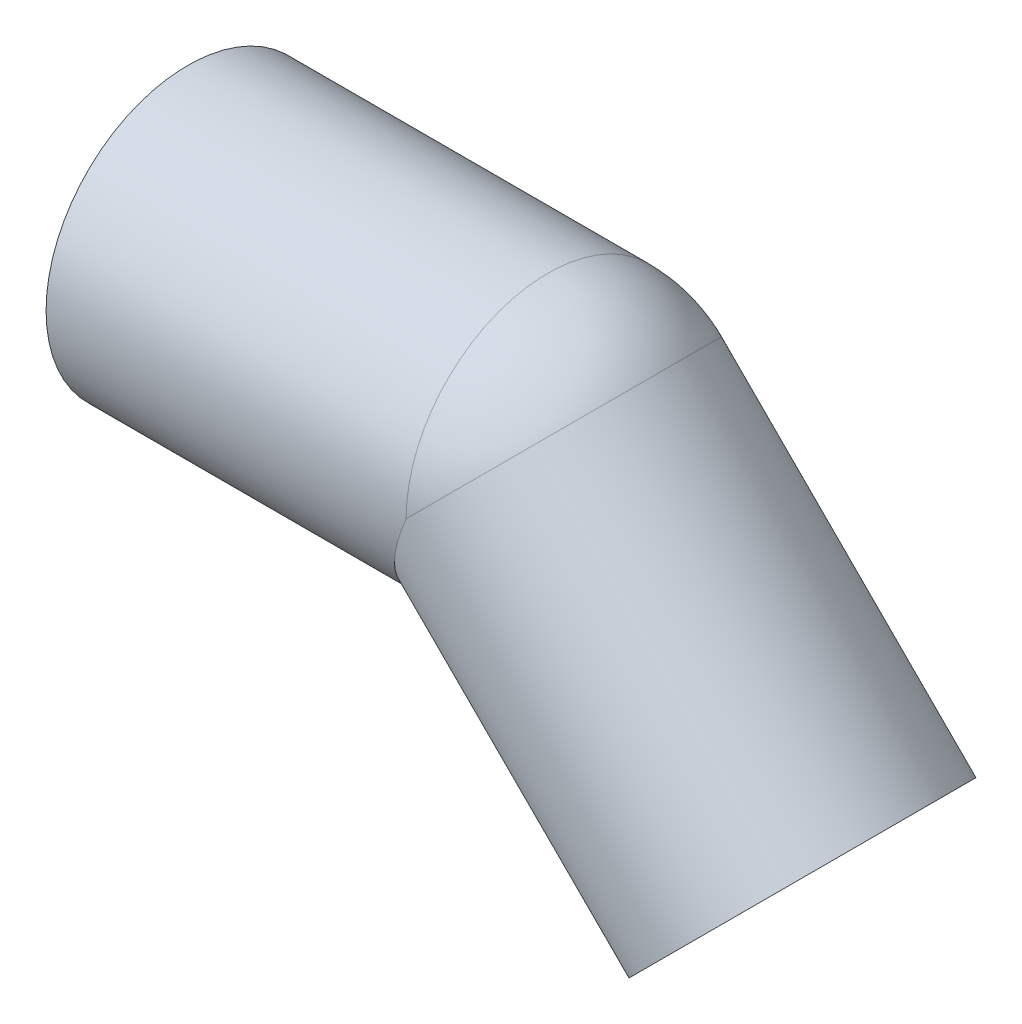
ISO-10303-21;
HEADER;
FILE_DESCRIPTION(('STEP AP214'),'2;1');
FILE_NAME('part.step','',(''),(''),'','','');
FILE_SCHEMA(('AUTOMOTIVE_DESIGN { 1 0 10303 214 1 1 1 1 }'));
ENDSEC;
DATA;
#1=APPLICATION_CONTEXT('core data for automotive mechanical design processes');
#2=APPLICATION_PROTOCOL_DEFINITION('international standard','automotive_design',2000,#1);
#3=PRODUCT_CONTEXT('',#1,'mechanical');
#4=PRODUCT('Part','Part','',(#3));
#5=PRODUCT_RELATED_PRODUCT_CATEGORY('part','',(#4));
#6=PRODUCT_DEFINITION_FORMATION('','',#4);
#7=PRODUCT_DEFINITION_CONTEXT('part definition',#1,'design');
#8=PRODUCT_DEFINITION('design','',#6,#7);
#9=PRODUCT_DEFINITION_SHAPE('','',#8);
#10=(LENGTH_UNIT() NAMED_UNIT(*) SI_UNIT(.MILLI.,.METRE.));
#11=(NAMED_UNIT(*) PLANE_ANGLE_UNIT() SI_UNIT($,.RADIAN.));
#12=(NAMED_UNIT(*) SI_UNIT($,.STERADIAN.) SOLID_ANGLE_UNIT());
#13=UNCERTAINTY_MEASURE_WITH_UNIT(LENGTH_MEASURE(1.E-05),#10,'distance_accuracy_value','');
#14=(GEOMETRIC_REPRESENTATION_CONTEXT(3) GLOBAL_UNCERTAINTY_ASSIGNED_CONTEXT((#13)) GLOBAL_UNIT_ASSIGNED_CONTEXT((#10,
#11,#12)) REPRESENTATION_CONTEXT('',''));
#15=CARTESIAN_POINT('',(0.,0.,0.));
#16=DIRECTION('',(0.,0.,1.));
#17=DIRECTION('',(1.,0.,0.));
#18=AXIS2_PLACEMENT_3D('',#15,#16,#17);
#19=CARTESIAN_POINT('',(136.568542494924,-56.5685424949251,0.));
#20=DIRECTION('',(-0.707106781186529,0.707106781186566,0.));
#21=DIRECTION('',(-0.707106781186566,-0.707106781186529,0.));
#22=AXIS2_PLACEMENT_3D('',#19,#20,#21);
#23=CYLINDRICAL_SURFACE('',#22,25.7);
#24=CARTESIAN_POINT('',(80.,0.,0.));
#25=DIRECTION('',(0.707106781186548,-0.707106781186547,0.));
#26=DIRECTION('',(0.,0.,-1.));
#27=AXIS2_PLACEMENT_3D('',#24,#25,#26);
#28=CIRCLE('',#27,25.7);
#29=CARTESIAN_POINT('',(98.1726442757443,18.1726442772443,0.));
#30=VERTEX_POINT('',#29);
#31=CARTESIAN_POINT('',(80.0000000000013,-5.52546202811329E-13,25.7));
#32=VERTEX_POINT('',#31);
#33=EDGE_CURVE('E53',#30,#32,#28,.T.);
#34=ORIENTED_EDGE('',*,*,#33,.F.);
#35=CARTESIAN_POINT('',(80.,0.,0.));
#36=DIRECTION('',(0.707106781274096,-0.707106781098999,0.));
#37=DIRECTION('',(0.,0.,-1.));
#38=AXIS2_PLACEMENT_3D('',#35,#36,#37);
#39=CIRCLE('',#38,25.7);
#40=CARTESIAN_POINT('',(80.0000000000013,-5.47206972808515E-13,-25.7));
#41=VERTEX_POINT('',#40);
#42=EDGE_CURVE('E46',#41,#30,#39,.T.);
#43=ORIENTED_EDGE('',*,*,#42,.F.);
#44=CARTESIAN_POINT('',(80.0000000000015,0.,0.));
#45=DIRECTION('',(-0.923879532511282,0.382683432365102,0.));
#46=DIRECTION('',(-0.382683432365102,-0.923879532511282,0.));
#47=AXIS2_PLACEMENT_3D('',#44,#45,#46);
#48=ELLIPSE('',#47,27.8174795475147,25.7);
#49=EDGE_CURVE('E55',#32,#41,#48,.F.);
#50=ORIENTED_EDGE('',*,*,#49,.F.);
#51=EDGE_LOOP('',(#34,#43,#50));
#52=FACE_BOUND('',#51,.T.);
#53=CARTESIAN_POINT('',(136.568542494923,-56.5685424949241,0.));
#54=DIRECTION('',(-0.707106781186528,0.707106781186567,0.));
#55=DIRECTION('',(-0.707106781186567,-0.707106781186528,0.));
#56=AXIS2_PLACEMENT_3D('',#53,#54,#55);
#57=CIRCLE('',#56,25.7);
#58=CARTESIAN_POINT('',(118.395898218428,-74.7411867714179,0.));
#59=VERTEX_POINT('',#58);
#60=EDGE_CURVE('E18',#59,#59,#57,.T.);
#61=ORIENTED_EDGE('',*,*,#60,.F.);
#62=EDGE_LOOP('',(#61));
#63=FACE_BOUND('',#62,.T.);
#64=ADVANCED_FACE('F15',(#52,#63),#23,.F.);
#65=CARTESIAN_POINT('',(80.,0.,0.));
#66=DIRECTION('',(0.,0.,1.));
#67=DIRECTION('',(-1.,0.,0.));
#68=AXIS2_PLACEMENT_3D('',#65,#66,#67);
#69=SPHERICAL_SURFACE('',#68,25.7);
#70=CARTESIAN_POINT('',(80.,0.,0.));
#71=DIRECTION('',(-1.,0.,0.));
#72=DIRECTION('',(0.,1.,0.));
#73=AXIS2_PLACEMENT_3D('',#70,#71,#72);
#74=CIRCLE('',#73,25.7);
#75=EDGE_CURVE('E51',#41,#32,#74,.F.);
#76=ORIENTED_EDGE('',*,*,#75,.F.);
#77=ORIENTED_EDGE('',*,*,#42,.T.);
#78=ORIENTED_EDGE('',*,*,#33,.T.);
#79=EDGE_LOOP('',(#76,#77,#78));
#80=FACE_BOUND('',#79,.T.);
#81=ADVANCED_FACE('F58',(#80),#69,.F.);
#82=CARTESIAN_POINT('',(158.842406102305,-34.2946788875427,31.8780010540602));
#83=DIRECTION('',(0.707106781186546,-0.707106781186549,0.));
#84=DIRECTION('',(-0.707106781186549,-0.707106781186546,0.));
#85=AXIS2_PLACEMENT_3D('',#82,#83,#84);
#86=PLANE('',#85);
#87=ORIENTED_EDGE('',*,*,#60,.T.);
#88=EDGE_LOOP('',(#87));
#89=FACE_BOUND('',#88,.T.);
#90=CARTESIAN_POINT('',(136.568542494922,-56.568542494924,0.));
#91=DIRECTION('',(-0.707106781186529,0.707106781186566,0.));
#92=DIRECTION('',(-0.707106781186566,-0.707106781186529,0.));
#93=AXIS2_PLACEMENT_3D('',#90,#91,#92);
#94=CIRCLE('',#93,31.5);
#95=CARTESIAN_POINT('',(114.294678887546,-78.8424061022996,0.));
#96=VERTEX_POINT('',#95);
#97=EDGE_CURVE('E71',#96,#96,#94,.T.);
#98=ORIENTED_EDGE('',*,*,#97,.F.);
#99=EDGE_LOOP('',(#98));
#100=FACE_BOUND('',#99,.T.);
#101=ADVANCED_FACE('F80',(#89,#100),#86,.T.);
#102=CARTESIAN_POINT('',(80.,0.,0.));
#103=DIRECTION('',(-1.,0.,0.));
#104=DIRECTION('',(0.,0.,1.));
#105=AXIS2_PLACEMENT_3D('',#102,#103,#104);
#106=CYLINDRICAL_SURFACE('',#105,25.7);
#107=CARTESIAN_POINT('',(0.,0.,0.));
#108=DIRECTION('',(-1.,0.,0.));
#109=DIRECTION('',(0.,0.,1.));
#110=AXIS2_PLACEMENT_3D('',#107,#108,#109);
#111=CIRCLE('',#110,25.7);
#112=CARTESIAN_POINT('',(0.,0.,25.7));
#113=VERTEX_POINT('',#112);
#114=EDGE_CURVE('E68',#113,#113,#111,.F.);
#115=ORIENTED_EDGE('',*,*,#114,.F.);
#116=EDGE_LOOP('',(#115));
#117=FACE_BOUND('',#116,.T.);
#118=ORIENTED_EDGE('',*,*,#49,.T.);
#119=ORIENTED_EDGE('',*,*,#75,.T.);
#120=EDGE_LOOP('',(#118,#119));
#121=FACE_BOUND('',#120,.T.);
#122=ADVANCED_FACE('F83',(#117,#121),#106,.F.);
#123=CARTESIAN_POINT('',(80.,0.,0.));
#124=DIRECTION('',(0.,0.,1.));
#125=DIRECTION('',(1.,0.,0.));
#126=AXIS2_PLACEMENT_3D('',#123,#124,#125);
#127=SPHERICAL_SURFACE('',#126,31.5);
#128=CARTESIAN_POINT('',(80.,0.,0.));
#129=DIRECTION('',(-1.,0.,0.));
#130=DIRECTION('',(0.,1.,0.));
#131=AXIS2_PLACEMENT_3D('',#128,#129,#130);
#132=CIRCLE('',#131,31.5);
#133=CARTESIAN_POINT('',(80.0000000000013,-5.22587704182734E-13,31.5));
#134=VERTEX_POINT('',#133);
#135=CARTESIAN_POINT('',(80.0000000000013,-4.95649886938501E-13,-31.4999999999997));
#136=VERTEX_POINT('',#135);
#137=EDGE_CURVE('E67',#134,#136,#132,.T.);
#138=ORIENTED_EDGE('',*,*,#137,.F.);
#139=CARTESIAN_POINT('',(80.,0.,0.));
#140=DIRECTION('',(-0.707106781161533,0.707106781211562,0.));
#141=DIRECTION('',(0.,0.,1.));
#142=AXIS2_PLACEMENT_3D('',#139,#140,#141);
#143=CIRCLE('',#142,31.5);
#144=CARTESIAN_POINT('',(102.27386360777,22.273863606982,0.));
#145=VERTEX_POINT('',#144);
#146=EDGE_CURVE('E73',#134,#145,#143,.T.);
#147=ORIENTED_EDGE('',*,*,#146,.T.);
#148=CARTESIAN_POINT('',(80.0000000000007,7.52869988573934E-13,0.));
#149=DIRECTION('',(-0.707106781186528,0.707106781186567,0.));
#150=DIRECTION('',(0.707106781186566,0.707106781186528,0.));
#151=AXIS2_PLACEMENT_3D('',#148,#149,#150);
#152=CIRCLE('',#151,31.4999999999989);
#153=EDGE_CURVE('E33',#136,#145,#152,.F.);
#154=ORIENTED_EDGE('',*,*,#153,.F.);
#155=EDGE_LOOP('',(#138,#147,#154));
#156=FACE_BOUND('',#155,.T.);
#157=ADVANCED_FACE('F87',(#156),#127,.T.);
#158=CARTESIAN_POINT('',(80.0000000000007,7.49400541621981E-13,0.));
#159=DIRECTION('',(-0.707106781186529,0.707106781186566,0.));
#160=DIRECTION('',(-0.707106781186566,-0.707106781186529,0.));
#161=AXIS2_PLACEMENT_3D('',#158,#159,#160);
#162=CYLINDRICAL_SURFACE('',#161,31.5);
#163=ORIENTED_EDGE('',*,*,#97,.T.);
#164=EDGE_LOOP('',(#163));
#165=FACE_BOUND('',#164,.T.);
#166=CARTESIAN_POINT('',(80.0000000000015,0.,0.));
#167=DIRECTION('',(-0.923879532511282,0.382683432365102,0.));
#168=DIRECTION('',(-0.382683432365102,-0.923879532511282,0.));
#169=AXIS2_PLACEMENT_3D('',#166,#167,#168);
#170=ELLIPSE('',#169,34.0953543092106,31.5);
#171=EDGE_CURVE('E24',#136,#134,#170,.T.);
#172=ORIENTED_EDGE('',*,*,#171,.F.);
#173=ORIENTED_EDGE('',*,*,#153,.T.);
#174=ORIENTED_EDGE('',*,*,#146,.F.);
#175=EDGE_LOOP('',(#172,#173,#174));
#176=FACE_BOUND('',#175,.T.);
#177=ADVANCED_FACE('F91',(#165,#176),#162,.T.);
#178=CARTESIAN_POINT('',(0.,-31.5,31.8780010542674));
#179=DIRECTION('',(-1.,0.,0.));
#180=DIRECTION('',(0.,1.,0.));
#181=AXIS2_PLACEMENT_3D('',#178,#179,#180);
#182=PLANE('',#181);
#183=ORIENTED_EDGE('',*,*,#114,.T.);
#184=EDGE_LOOP('',(#183));
#185=FACE_BOUND('',#184,.T.);
#186=CARTESIAN_POINT('',(0.,0.,0.));
#187=DIRECTION('',(-1.,0.,0.));
#188=DIRECTION('',(0.,0.,1.));
#189=AXIS2_PLACEMENT_3D('',#186,#187,#188);
#190=CIRCLE('',#189,31.5);
#191=CARTESIAN_POINT('',(0.,0.,31.5));
#192=VERTEX_POINT('',#191);
#193=EDGE_CURVE('E9',#192,#192,#190,.F.);
#194=ORIENTED_EDGE('',*,*,#193,.F.);
#195=EDGE_LOOP('',(#194));
#196=FACE_BOUND('',#195,.T.);
#197=ADVANCED_FACE('F105',(#185,#196),#182,.T.);
#198=CARTESIAN_POINT('',(0.,0.,0.));
#199=DIRECTION('',(-1.,0.,0.));
#200=DIRECTION('',(0.,0.,1.));
#201=AXIS2_PLACEMENT_3D('',#198,#199,#200);
#202=CYLINDRICAL_SURFACE('',#201,31.5);
#203=ORIENTED_EDGE('',*,*,#171,.T.);
#204=ORIENTED_EDGE('',*,*,#137,.T.);
#205=EDGE_LOOP('',(#203,#204));
#206=FACE_BOUND('',#205,.T.);
#207=ORIENTED_EDGE('',*,*,#193,.T.);
#208=EDGE_LOOP('',(#207));
#209=FACE_BOUND('',#208,.T.);
#210=ADVANCED_FACE('F102',(#206,#209),#202,.T.);
#211=CLOSED_SHELL('',(#64,#81,#101,#122,#157,#177,#197,#210));
#212=MANIFOLD_SOLID_BREP('B1',#211);
#213=ADVANCED_BREP_SHAPE_REPRESENTATION('',(#18,#212),#14);
#214=SHAPE_DEFINITION_REPRESENTATION(#9,#213);
ENDSEC;
END-ISO-10303-21;
